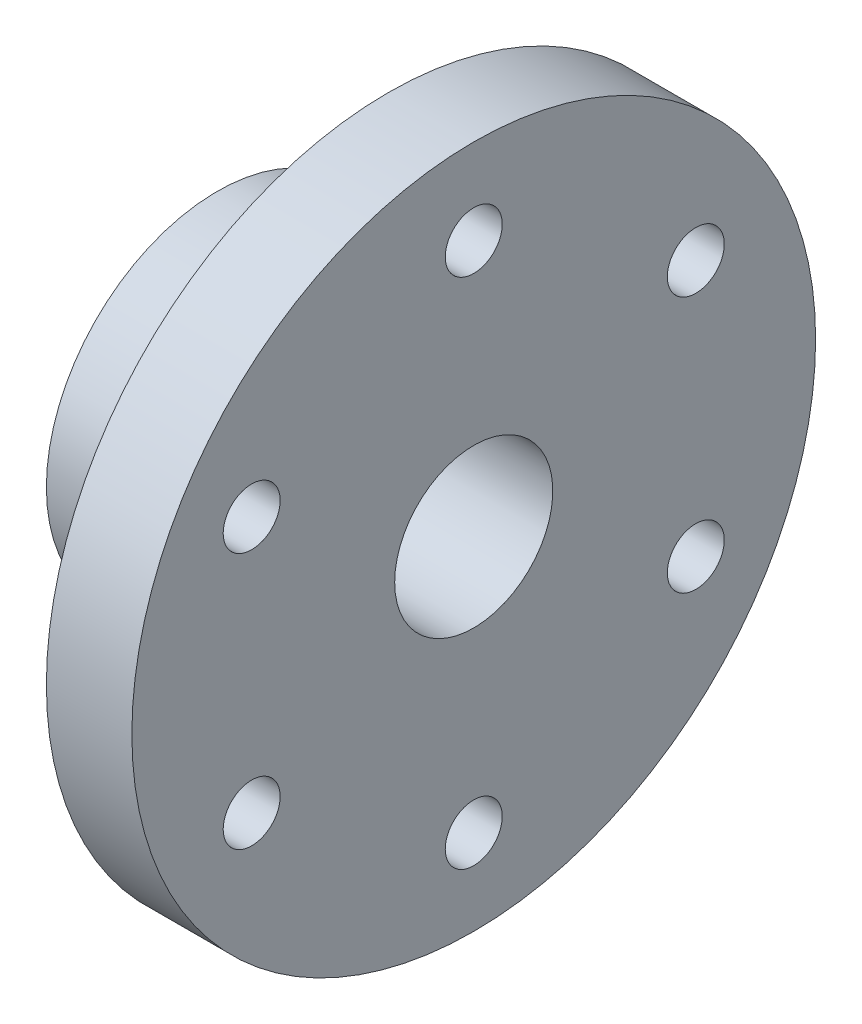
ISO-10303-21;
HEADER;
FILE_DESCRIPTION(('STEP AP214'),'2;1');
FILE_NAME('part.step','',(''),(''),'','','');
FILE_SCHEMA(('AUTOMOTIVE_DESIGN { 1 0 10303 214 1 1 1 1 }'));
ENDSEC;
DATA;
#1=APPLICATION_CONTEXT('core data for automotive mechanical design processes');
#2=APPLICATION_PROTOCOL_DEFINITION('international standard','automotive_design',2000,#1);
#3=PRODUCT_CONTEXT('',#1,'mechanical');
#4=PRODUCT('Part','Part','',(#3));
#5=PRODUCT_RELATED_PRODUCT_CATEGORY('part','',(#4));
#6=PRODUCT_DEFINITION_FORMATION('','',#4);
#7=PRODUCT_DEFINITION_CONTEXT('part definition',#1,'design');
#8=PRODUCT_DEFINITION('design','',#6,#7);
#9=PRODUCT_DEFINITION_SHAPE('','',#8);
#10=(LENGTH_UNIT() NAMED_UNIT(*) SI_UNIT(.MILLI.,.METRE.));
#11=(NAMED_UNIT(*) PLANE_ANGLE_UNIT() SI_UNIT($,.RADIAN.));
#12=(NAMED_UNIT(*) SI_UNIT($,.STERADIAN.) SOLID_ANGLE_UNIT());
#13=UNCERTAINTY_MEASURE_WITH_UNIT(LENGTH_MEASURE(1.E-05),#10,'distance_accuracy_value','');
#14=(GEOMETRIC_REPRESENTATION_CONTEXT(3) GLOBAL_UNCERTAINTY_ASSIGNED_CONTEXT((#13)) GLOBAL_UNIT_ASSIGNED_CONTEXT((#10,
#11,#12)) REPRESENTATION_CONTEXT('',''));
#15=CARTESIAN_POINT('',(0.,0.,0.));
#16=DIRECTION('',(0.,0.,1.));
#17=DIRECTION('',(1.,0.,0.));
#18=AXIS2_PLACEMENT_3D('',#15,#16,#17);
#19=CARTESIAN_POINT('',(-11.6129032258065,0.,0.));
#20=DIRECTION('',(-1.,0.,0.));
#21=DIRECTION('',(0.,0.,1.));
#22=AXIS2_PLACEMENT_3D('',#19,#20,#21);
#23=CYLINDRICAL_SURFACE('',#22,24.);
#24=CARTESIAN_POINT('',(-9.70046082949309,0.,24.));
#25=CARTESIAN_POINT('',(-9.7004697718096,-0.223025447933144,23.9999961787012));
#26=CARTESIAN_POINT('',(-9.71917646944337,-0.446172610942113,23.9968588466085));
#27=CARTESIAN_POINT('',(-9.79347788351762,-0.886208354676868,23.9846455190622));
#28=CARTESIAN_POINT('',(-9.84910652055166,-1.1030909887348,23.9755640627822));
#29=CARTESIAN_POINT('',(-9.9955255472415,-1.52416759554023,23.9524810917832));
#30=CARTESIAN_POINT('',(-10.086287174518,-1.72837178949104,23.9384836025471));
#31=CARTESIAN_POINT('',(-10.3003204967769,-2.11862694716471,23.9071076333131));
#32=CARTESIAN_POINT('',(-10.4235884734659,-2.30467998380575,23.8897295400709));
#33=CARTESIAN_POINT('',(-10.7003889636058,-2.65515618286669,23.853333079333));
#34=CARTESIAN_POINT('',(-10.8541714129109,-2.81938064565595,23.8343019490377));
#35=CARTESIAN_POINT('',(-11.1870975790496,-3.11982159785588,23.7968420300277));
#36=CARTESIAN_POINT('',(-11.3662428958237,-3.25603631902555,23.7784132794027));
#37=CARTESIAN_POINT('',(-11.7461743754084,-3.49738740096821,23.7441210521565));
#38=CARTESIAN_POINT('',(-11.9470869683807,-3.6023272845776,23.7282740654662));
#39=CARTESIAN_POINT('',(-12.3639961323741,-3.77689338465795,23.7011166367148));
#40=CARTESIAN_POINT('',(-12.5799916833773,-3.84652198650498,23.6898058882289));
#41=CARTESIAN_POINT('',(-13.0188292692636,-3.94786300445569,23.6731285894841));
#42=CARTESIAN_POINT('',(-13.2415900078953,-3.97991844661664,23.6677082957712));
#43=CARTESIAN_POINT('',(-13.6893892725066,-4.0062667604638,23.6632630229864));
#44=CARTESIAN_POINT('',(-13.9144276361608,-4.0005623046224,23.6642375913154));
#45=CARTESIAN_POINT('',(-14.3579454075338,-3.95183215743384,23.6724228618169));
#46=CARTESIAN_POINT('',(-14.5764685151655,-3.90919181102364,23.6795691731027));
#47=CARTESIAN_POINT('',(-15.0032149380197,-3.78840502464551,23.6991919233761));
#48=CARTESIAN_POINT('',(-15.2114378997148,-3.71025736691159,23.7116685451723));
#49=CARTESIAN_POINT('',(-15.6128269469986,-3.52028359375026,23.7406156693456));
#50=CARTESIAN_POINT('',(-15.8059158792231,-3.40829746220754,23.7571050737172));
#51=CARTESIAN_POINT('',(-16.1707078703545,-3.1539392280919,23.7922066946401));
#52=CARTESIAN_POINT('',(-16.342409201421,-3.01156467304686,23.8108190824686));
#53=CARTESIAN_POINT('',(-16.6617825667848,-2.69837153945449,23.8483524460766));
#54=CARTESIAN_POINT('',(-16.8091304591572,-2.527222342197,23.8672743877064));
#55=CARTESIAN_POINT('',(-17.0730652497576,-2.16245639837063,23.9030816223476));
#56=CARTESIAN_POINT('',(-17.1896519497863,-1.96883950705028,23.9199669022359));
#57=CARTESIAN_POINT('',(-17.3887843929111,-1.56432946586674,23.9498222862866));
#58=CARTESIAN_POINT('',(-17.4713015004231,-1.35342196090346,23.9627890945191));
#59=CARTESIAN_POINT('',(-17.5996515738867,-0.92047735296437,23.9833200482025));
#60=CARTESIAN_POINT('',(-17.645487608651,-0.69844118268715,23.9908846456076));
#61=CARTESIAN_POINT('',(-17.6987350030309,-0.252335842082599,23.999698077483));
#62=CARTESIAN_POINT('',(-17.7065913443821,-0.028321179441619,24.0010200482045));
#63=CARTESIAN_POINT('',(-17.6848426784081,0.417823636623819,23.9973995907387));
#64=CARTESIAN_POINT('',(-17.6552391124791,0.639953862227262,23.9924574035859));
#65=CARTESIAN_POINT('',(-17.5597810705563,1.07464988087482,23.9769092310112));
#66=CARTESIAN_POINT('',(-17.4941468960689,1.28726538941661,23.966337676821));
#67=CARTESIAN_POINT('',(-17.3287256003738,1.69847501577671,23.9407114312857));
#68=CARTESIAN_POINT('',(-17.2289365612767,1.89706834545555,23.9256564881923));
#69=CARTESIAN_POINT('',(-16.9970190299782,2.27652910315033,23.8925522608385));
#70=CARTESIAN_POINT('',(-16.8646125796255,2.45722440149944,23.8744776941924));
#71=CARTESIAN_POINT('',(-16.571601124877,2.7939897368043,23.8374154782704));
#72=CARTESIAN_POINT('',(-16.4109940722504,2.95005798351453,23.8184277627447));
#73=CARTESIAN_POINT('',(-16.0641447525788,3.2347884474528,23.7814428037735));
#74=CARTESIAN_POINT('',(-15.87765416467,3.36315001778194,23.7634578581937));
#75=CARTESIAN_POINT('',(-15.4854960788714,3.58672369647198,23.7307444764461));
#76=CARTESIAN_POINT('',(-15.2798291891291,3.68193685563172,23.7160159370563));
#77=CARTESIAN_POINT('',(-14.8559972569937,3.83606133035704,23.6915752591633));
#78=CARTESIAN_POINT('',(-14.6378878774443,3.89512229207671,23.681842468977));
#79=CARTESIAN_POINT('',(-14.1946686227383,3.97573672604524,23.6684434693642));
#80=CARTESIAN_POINT('',(-13.9695593579218,3.99729345911387,23.6647767325235));
#81=CARTESIAN_POINT('',(-13.5217325639532,4.00219658567577,23.6639477293442));
#82=CARTESIAN_POINT('',(-13.2990202237726,3.9860162178003,23.6667049040904));
#83=CARTESIAN_POINT('',(-12.8595340326119,3.91692774233096,23.6782365032596));
#84=CARTESIAN_POINT('',(-12.6427601623861,3.86401975377996,23.6870109081794));
#85=CARTESIAN_POINT('',(-12.2214873298249,3.72315918335184,23.7095577005075));
#86=CARTESIAN_POINT('',(-12.0169744134035,3.63524734496071,23.7233242755147));
#87=CARTESIAN_POINT('',(-11.6255237587813,3.42692320626545,23.7543099027553));
#88=CARTESIAN_POINT('',(-11.4385868928977,3.3065092939977,23.7715291262144));
#89=CARTESIAN_POINT('',(-11.0852038965207,3.03491021499545,23.8077352647299));
#90=CARTESIAN_POINT('',(-10.9190272027727,2.88337690174984,23.8267407292208));
#91=CARTESIAN_POINT('',(-10.6142982623332,2.55457445020837,23.8642299577735));
#92=CARTESIAN_POINT('',(-10.475752399672,2.37729938066022,23.8827136004247));
#93=CARTESIAN_POINT('',(-10.2293436003732,2.00059067142445,23.9172244742755));
#94=CARTESIAN_POINT('',(-10.1216991665924,1.80101246005251,23.9332338600497));
#95=CARTESIAN_POINT('',(-9.94162965411722,1.38642091100637,23.9608186816284));
#96=CARTESIAN_POINT('',(-9.86916949976558,1.17142319172802,23.9723985308397));
#97=CARTESIAN_POINT('',(-9.77725239089043,0.796325296072642,23.9872926533273));
#98=CARTESIAN_POINT('',(-9.74850167810755,0.638494128477517,23.9920324363737));
#99=CARTESIAN_POINT('',(-9.71010284894149,0.320462896511695,23.9983874557779));
#100=CARTESIAN_POINT('',(-9.70045440367331,0.160262872973591,24.0000027459303));
#101=CARTESIAN_POINT('',(-9.70046082949309,0.,24.));
#102=B_SPLINE_CURVE_WITH_KNOTS('',3,(#24,#25,#26,#27,#28,#29,#30,#31,#32,#33,#34,#35,#36,#37,
#38,#39,#40,#41,#42,#43,#44,#45,#46,#47,#48,#49,#50,#51,#52,#53,#54,#55,#56,#57,#58,#59,#60,#61,
#62,#63,#64,#65,#66,#67,#68,#69,#70,#71,#72,#73,#74,#75,#76,#77,#78,#79,#80,#81,#82,#83,#84,#85,
#86,#87,#88,#89,#90,#91,#92,#93,#94,#95,#96,#97,#98,#99,#100,#101),.UNSPECIFIED.,.T.,.F.,(4,2,2,
2,2,2,2,2,2,2,2,2,2,2,2,2,2,2,2,2,2,2,2,2,2,2,2,2,2,2,2,2,2,2,2,2,2,2,4),(0.,0.668490535901615,
1.33759607311267,2.00615498724043,2.67463746027966,3.34883985699731,4.02308480271771,
4.70148033318144,5.3798300300189,6.05193723365478,6.72399686913418,7.38912834816654,
8.0542826404061,8.72263290612092,9.39103713088918,10.0677243185812,10.7444158661736,
11.4216750226545,12.0988775123384,12.7681261358624,13.4373490085738,14.1025249121026,
14.7677381732171,15.4388292100324,16.1099690088685,16.7880611521219,17.4661317980151,
18.1413763574684,18.8165622045859,19.4833265523632,20.1500887390101,20.8160770916196,
21.4820984804694,22.1560221470943,22.8301013420636,23.5088357057152,24.1868920340812,
24.6672679706243,25.1476356364315),.UNSPECIFIED.);
#103=CARTESIAN_POINT('',(-9.70046082949309,0.,24.));
#104=VERTEX_POINT('',#103);
#105=EDGE_CURVE('E90',#104,#104,#102,.T.);
#106=ORIENTED_EDGE('',*,*,#105,.T.);
#107=EDGE_LOOP('',(#106));
#108=FACE_BOUND('',#107,.T.);
#109=CARTESIAN_POINT('',(-25.7004608294931,0.,0.));
#110=DIRECTION('',(-1.,0.,0.));
#111=DIRECTION('',(0.,0.,1.));
#112=AXIS2_PLACEMENT_3D('',#109,#110,#111);
#113=CIRCLE('',#112,24.);
#114=CARTESIAN_POINT('',(-25.7004608294931,0.,24.));
#115=VERTEX_POINT('',#114);
#116=EDGE_CURVE('E10',#115,#115,#113,.T.);
#117=ORIENTED_EDGE('',*,*,#116,.F.);
#118=EDGE_LOOP('',(#117));
#119=FACE_BOUND('',#118,.T.);
#120=CARTESIAN_POINT('',(-1.70046082949309,0.,0.));
#121=DIRECTION('',(-1.,0.,0.));
#122=DIRECTION('',(0.,0.,1.));
#123=AXIS2_PLACEMENT_3D('',#120,#121,#122);
#124=CIRCLE('',#123,24.);
#125=CARTESIAN_POINT('',(-1.70046082949309,0.,24.));
#126=VERTEX_POINT('',#125);
#127=EDGE_CURVE('E55',#126,#126,#124,.T.);
#128=ORIENTED_EDGE('',*,*,#127,.T.);
#129=EDGE_LOOP('',(#128));
#130=FACE_BOUND('',#129,.T.);
#131=ADVANCED_FACE('F32',(#108,#119,#130),#23,.T.);
#132=CARTESIAN_POINT('',(-25.7004608294931,11.1,0.));
#133=DIRECTION('',(1.,0.,0.));
#134=DIRECTION('',(0.,0.,-1.));
#135=AXIS2_PLACEMENT_3D('',#132,#133,#134);
#136=PLANE('',#135);
#137=CARTESIAN_POINT('',(-25.7004608294931,0.,0.));
#138=DIRECTION('',(-1.,0.,0.));
#139=DIRECTION('',(0.,0.,1.));
#140=AXIS2_PLACEMENT_3D('',#137,#138,#139);
#141=CIRCLE('',#140,11.1);
#142=CARTESIAN_POINT('',(-25.7004608294931,0.,11.1));
#143=VERTEX_POINT('',#142);
#144=EDGE_CURVE('E39',#143,#143,#141,.T.);
#145=ORIENTED_EDGE('',*,*,#144,.F.);
#146=EDGE_LOOP('',(#145));
#147=FACE_BOUND('',#146,.T.);
#148=ORIENTED_EDGE('',*,*,#116,.T.);
#149=EDGE_LOOP('',(#148));
#150=FACE_BOUND('',#149,.T.);
#151=ADVANCED_FACE('F151',(#147,#150),#136,.F.);
#152=CARTESIAN_POINT('',(-11.6129032258065,0.,0.));
#153=DIRECTION('',(-1.,0.,0.));
#154=DIRECTION('',(0.,0.,1.));
#155=AXIS2_PLACEMENT_3D('',#152,#153,#154);
#156=CYLINDRICAL_SURFACE('',#155,11.1);
#157=CARTESIAN_POINT('',(-9.70046082949309,0.,11.1));
#158=CARTESIAN_POINT('',(-9.70045577108389,-0.217216618898547,11.1000036677997));
#159=CARTESIAN_POINT('',(-9.71821069737451,-0.434397419127927,11.0935671862936));
#160=CARTESIAN_POINT('',(-9.78849966258006,-0.862301453856844,11.0685304589151));
#161=CARTESIAN_POINT('',(-9.84103170703669,-1.07302505794977,11.049930910592));
#162=CARTESIAN_POINT('',(-9.97879813032089,-1.48178351730868,11.0025735524127));
#163=CARTESIAN_POINT('',(-10.0639724306934,-1.67984090803647,10.9738344122637));
#164=CARTESIAN_POINT('',(-10.2643123098248,-2.05884964258268,10.9090857081488));
#165=CARTESIAN_POINT('',(-10.379485235332,-2.23979678123494,10.8730743636855));
#166=CARTESIAN_POINT('',(-10.641335377689,-2.58662726021929,10.7959281925309));
#167=CARTESIAN_POINT('',(-10.7889920197429,-2.75174039279639,10.7546561883183));
#168=CARTESIAN_POINT('',(-11.1095382989785,-3.05546974190143,10.6723433795021));
#169=CARTESIAN_POINT('',(-11.2824348026464,-3.19407872421639,10.6313026409798));
#170=CARTESIAN_POINT('',(-11.6558618342691,-3.44557751347248,10.5525352586091));
#171=CARTESIAN_POINT('',(-11.8571416875724,-3.55741111015791,10.51497248268));
#172=CARTESIAN_POINT('',(-12.277222358985,-3.74530081075661,10.4495308172368));
#173=CARTESIAN_POINT('',(-12.4960167527226,-3.82136996341279,10.4216483967946));
#174=CARTESIAN_POINT('',(-12.9360830128534,-3.93258516524641,10.3801828295834));
#175=CARTESIAN_POINT('',(-13.1569361960111,-3.96919217103409,10.3660911234836));
#176=CARTESIAN_POINT('',(-13.6020654574061,-4.00501241228621,10.3523079757702));
#177=CARTESIAN_POINT('',(-13.8263402261681,-4.00423961145143,10.3526111567633));
#178=CARTESIAN_POINT('',(-14.2589232562499,-3.9664454427848,10.3671424021891));
#179=CARTESIAN_POINT('',(-14.4674347917533,-3.93140511631736,10.3806094309751));
#180=CARTESIAN_POINT('',(-14.875391453863,-3.82932980894775,10.418693283566));
#181=CARTESIAN_POINT('',(-15.074835315726,-3.76229037976972,10.4433116575231));
#182=CARTESIAN_POINT('',(-15.4631992787148,-3.5969580295675,10.5014123473317));
#183=CARTESIAN_POINT('',(-15.6518659019734,-3.49812519483223,10.5350459809749));
#184=CARTESIAN_POINT('',(-16.0105301209303,-3.27238706537428,10.607332402667));
#185=CARTESIAN_POINT('',(-16.1805216051682,-3.14547262162421,10.645986824797));
#186=CARTESIAN_POINT('',(-16.5080387567402,-2.85794684393414,10.7268704725522));
#187=CARTESIAN_POINT('',(-16.6641487084318,-2.69573986549957,10.7691731305716));
#188=CARTESIAN_POINT('',(-16.9473533859277,-2.34694698345684,10.8505241229456));
#189=CARTESIAN_POINT('',(-17.0744443093173,-2.1603578900475,10.8895720303993));
#190=CARTESIAN_POINT('',(-17.2974068102601,-1.76470908178319,10.9606878025247));
#191=CARTESIAN_POINT('',(-17.3928406230375,-1.55538347982955,10.9926559100633));
#192=CARTESIAN_POINT('',(-17.5466799984054,-1.12221352602812,11.0452767145418));
#193=CARTESIAN_POINT('',(-17.6051006965056,-0.898375150116255,11.0659340362513));
#194=CARTESIAN_POINT('',(-17.6806119455979,-0.454474246330642,11.0928097209141));
#195=CARTESIAN_POINT('',(-17.6996111875772,-0.234776381211075,11.0996942866314));
#196=CARTESIAN_POINT('',(-17.7012541183416,0.204748811496262,11.1002854061125));
#197=CARTESIAN_POINT('',(-17.6839051461205,0.42457610399239,11.0939946200849));
#198=CARTESIAN_POINT('',(-17.6148182233676,0.850094279993616,11.0693821138511));
#199=CARTESIAN_POINT('',(-17.5643018450618,1.05601076330863,11.0514880285444));
#200=CARTESIAN_POINT('',(-17.4318928492556,1.45632431062248,11.0058955989415));
#201=CARTESIAN_POINT('',(-17.3499961537448,1.65071987363417,10.9781959804087));
#202=CARTESIAN_POINT('',(-17.1546027204022,2.02865590704337,10.9147760514003));
#203=CARTESIAN_POINT('',(-17.0402735830839,2.21173047774159,10.878850052358));
#204=CARTESIAN_POINT('',(-16.7842138569878,2.55668673116662,10.8029902145338));
#205=CARTESIAN_POINT('',(-16.6424737341169,2.71856100705091,10.763054983591));
#206=CARTESIAN_POINT('',(-16.3266802258103,3.02555939269694,10.6809453846636));
#207=CARTESIAN_POINT('',(-16.1513042780573,3.16932504013694,10.6387654680166));
#208=CARTESIAN_POINT('',(-15.7780526630379,3.42561801459676,10.559034561974));
#209=CARTESIAN_POINT('',(-15.5801757480724,3.53814360813533,10.5214838295116));
#210=CARTESIAN_POINT('',(-15.1665413467906,3.72860621162998,10.4555118387731));
#211=CARTESIAN_POINT('',(-14.950756261635,3.80648861162101,10.4271050138793));
#212=CARTESIAN_POINT('',(-14.50784071553,3.92435690195699,10.3833257254739));
#213=CARTESIAN_POINT('',(-14.2807166266602,3.96436383001615,10.3679460266202));
#214=CARTESIAN_POINT('',(-13.8361612019318,4.00354633094279,10.3528746953999));
#215=CARTESIAN_POINT('',(-13.6189600086165,4.00501551734795,10.3523018495131));
#216=CARTESIAN_POINT('',(-13.1875822779526,3.9728734993801,10.3646787904784));
#217=CARTESIAN_POINT('',(-12.9734054981326,3.93926512359326,10.3776274869797));
#218=CARTESIAN_POINT('',(-12.5597735164741,3.83965299108029,10.4148816933837));
#219=CARTESIAN_POINT('',(-12.3600803294756,3.77451430626248,10.4388831471888));
#220=CARTESIAN_POINT('',(-11.9743242443391,3.61442830949985,10.495383666482));
#221=CARTESIAN_POINT('',(-11.7882646710442,3.51947375597137,10.5278847960236));
#222=CARTESIAN_POINT('',(-11.4250746579787,3.29699598639465,10.5997219785334));
#223=CARTESIAN_POINT('',(-11.2488395194924,3.16809547458699,10.6393163821297));
#224=CARTESIAN_POINT('',(-10.9197648778929,2.88358661303405,10.7199238640854));
#225=CARTESIAN_POINT('',(-10.766932540985,2.72797011336611,10.7609373722965));
#226=CARTESIAN_POINT('',(-10.4814884456053,2.38542835212334,10.8421461961024));
#227=CARTESIAN_POINT('',(-10.3502134170354,2.19735227122791,10.8822058297863));
#228=CARTESIAN_POINT('',(-10.1212211670102,1.80042322025713,10.9548679468535));
#229=CARTESIAN_POINT('',(-10.0235022931234,1.5915712739171,10.9874707974105));
#230=CARTESIAN_POINT('',(-9.86419665506637,1.15642623968461,11.0417941479022));
#231=CARTESIAN_POINT('',(-9.80302248997312,0.92996545740235,11.0633899904646));
#232=CARTESIAN_POINT('',(-9.7211655752826,0.468986984757081,11.0924880591668));
#233=CARTESIAN_POINT('',(-9.70046628974972,0.234472624531695,11.099996040825));
#234=CARTESIAN_POINT('',(-9.70046082949309,0.,11.1));
#235=B_SPLINE_CURVE_WITH_KNOTS('',3,(#157,#158,#159,#160,#161,#162,#163,#164,#165,#166,#167,
#168,#169,#170,#171,#172,#173,#174,#175,#176,#177,#178,#179,#180,#181,#182,#183,#184,#185,#186,
#187,#188,#189,#190,#191,#192,#193,#194,#195,#196,#197,#198,#199,#200,#201,#202,#203,#204,#205,
#206,#207,#208,#209,#210,#211,#212,#213,#214,#215,#216,#217,#218,#219,#220,#221,#222,#223,#224,
#225,#226,#227,#228,#229,#230,#231,#232,#233,#234),.UNSPECIFIED.,.T.,.F.,(4,2,2,2,2,2,2,2,2,2,2,
2,2,2,2,2,2,2,2,2,2,2,2,2,2,2,2,2,2,2,2,2,2,2,2,2,2,2,4),(0.,0.650785699236126,1.30153407932134,
1.95109045713628,2.60080606296678,3.27375863490819,3.94689462547237,4.64332854909211,
5.33950817956733,6.00892120966243,6.67808417396337,7.31071883797618,7.94344147175084,
8.58753274700214,9.23183417788969,9.91587813748762,10.6000116772082,11.2932455051655,
11.9861956706637,12.6447279219913,13.3031272232289,13.9385434756258,14.574042331183,
15.2276132429251,15.8814118899878,16.5701696452403,17.2589656113784,17.9488435494735,
18.6383380736073,19.2866971217152,19.935003891454,20.5664533039616,21.198056199681,
21.8608637413338,22.5238738381054,23.2189742860337,23.9140404996855,24.6168127422009,
25.319297808405),.UNSPECIFIED.);
#236=CARTESIAN_POINT('',(-9.70046082949309,0.,11.1));
#237=VERTEX_POINT('',#236);
#238=EDGE_CURVE('E101',#237,#237,#235,.T.);
#239=ORIENTED_EDGE('',*,*,#238,.F.);
#240=EDGE_LOOP('',(#239));
#241=FACE_BOUND('',#240,.T.);
#242=CARTESIAN_POINT('',(10.2995391705069,0.,0.));
#243=DIRECTION('',(-1.,0.,0.));
#244=DIRECTION('',(0.,0.,1.));
#245=AXIS2_PLACEMENT_3D('',#242,#243,#244);
#246=CIRCLE('',#245,11.1);
#247=CARTESIAN_POINT('',(10.2995391705069,0.,11.1));
#248=VERTEX_POINT('',#247);
#249=EDGE_CURVE('E43',#248,#248,#246,.T.);
#250=ORIENTED_EDGE('',*,*,#249,.F.);
#251=EDGE_LOOP('',(#250));
#252=FACE_BOUND('',#251,.T.);
#253=ORIENTED_EDGE('',*,*,#144,.T.);
#254=EDGE_LOOP('',(#253));
#255=FACE_BOUND('',#254,.T.);
#256=ADVANCED_FACE('F148',(#241,#252,#255),#156,.F.);
#257=CARTESIAN_POINT('',(10.2995391705069,48.,0.));
#258=DIRECTION('',(-1.,0.,0.));
#259=DIRECTION('',(0.,0.,1.));
#260=AXIS2_PLACEMENT_3D('',#257,#258,#259);
#261=PLANE('',#260);
#262=CARTESIAN_POINT('',(10.2995391705069,36.,0.));
#263=DIRECTION('',(-1.,0.,0.));
#264=DIRECTION('',(0.,0.,1.));
#265=AXIS2_PLACEMENT_3D('',#262,#263,#264);
#266=CIRCLE('',#265,4.);
#267=CARTESIAN_POINT('',(10.2995391705069,36.,4.));
#268=VERTEX_POINT('',#267);
#269=EDGE_CURVE('E58',#268,#268,#266,.F.);
#270=ORIENTED_EDGE('',*,*,#269,.F.);
#271=EDGE_LOOP('',(#270));
#272=FACE_BOUND('',#271,.T.);
#273=CARTESIAN_POINT('',(10.2995391705069,17.9999999999991,-31.1769145362393));
#274=DIRECTION('',(-1.,0.,0.));
#275=DIRECTION('',(0.,0.,1.));
#276=AXIS2_PLACEMENT_3D('',#273,#274,#275);
#277=CIRCLE('',#276,4.);
#278=CARTESIAN_POINT('',(10.2995391705069,17.9999999999991,-27.1769145362393));
#279=VERTEX_POINT('',#278);
#280=EDGE_CURVE('E66',#279,#279,#277,.F.);
#281=ORIENTED_EDGE('',*,*,#280,.F.);
#282=EDGE_LOOP('',(#281));
#283=FACE_BOUND('',#282,.T.);
#284=CARTESIAN_POINT('',(10.2995391705069,-18.0000000000009,-31.1769145362383));
#285=DIRECTION('',(-1.,0.,0.));
#286=DIRECTION('',(0.,0.,1.));
#287=AXIS2_PLACEMENT_3D('',#284,#285,#286);
#288=CIRCLE('',#287,4.);
#289=CARTESIAN_POINT('',(10.2995391705069,-18.0000000000009,-27.1769145362383));
#290=VERTEX_POINT('',#289);
#291=EDGE_CURVE('E59',#290,#290,#288,.F.);
#292=ORIENTED_EDGE('',*,*,#291,.F.);
#293=EDGE_LOOP('',(#292));
#294=FACE_BOUND('',#293,.T.);
#295=CARTESIAN_POINT('',(10.2995391705069,-36.,1.95916913198922E-12));
#296=DIRECTION('',(-1.,0.,0.));
#297=DIRECTION('',(0.,0.,1.));
#298=AXIS2_PLACEMENT_3D('',#295,#296,#297);
#299=CIRCLE('',#298,4.);
#300=CARTESIAN_POINT('',(10.2995391705069,-36.,4.00000000000196));
#301=VERTEX_POINT('',#300);
#302=EDGE_CURVE('E67',#301,#301,#299,.F.);
#303=ORIENTED_EDGE('',*,*,#302,.F.);
#304=EDGE_LOOP('',(#303));
#305=FACE_BOUND('',#304,.T.);
#306=CARTESIAN_POINT('',(10.2995391705069,-17.9999999999991,31.1769145362413));
#307=DIRECTION('',(-1.,0.,0.));
#308=DIRECTION('',(0.,0.,1.));
#309=AXIS2_PLACEMENT_3D('',#306,#307,#308);
#310=CIRCLE('',#309,4.00000000000001);
#311=CARTESIAN_POINT('',(10.2995391705069,-17.9999999999991,35.1769145362413));
#312=VERTEX_POINT('',#311);
#313=EDGE_CURVE('E73',#312,#312,#310,.F.);
#314=ORIENTED_EDGE('',*,*,#313,.F.);
#315=EDGE_LOOP('',(#314));
#316=FACE_BOUND('',#315,.T.);
#317=CARTESIAN_POINT('',(10.2995391705069,18.0000000000009,31.1769145362403));
#318=DIRECTION('',(-1.,0.,0.));
#319=DIRECTION('',(0.,0.,1.));
#320=AXIS2_PLACEMENT_3D('',#317,#318,#319);
#321=CIRCLE('',#320,4.00000000000001);
#322=CARTESIAN_POINT('',(10.2995391705069,18.0000000000009,35.1769145362403));
#323=VERTEX_POINT('',#322);
#324=EDGE_CURVE('E79',#323,#323,#321,.F.);
#325=ORIENTED_EDGE('',*,*,#324,.F.);
#326=EDGE_LOOP('',(#325));
#327=FACE_BOUND('',#326,.T.);
#328=CARTESIAN_POINT('',(10.2995391705069,0.,0.));
#329=DIRECTION('',(-1.,0.,0.));
#330=DIRECTION('',(0.,0.,1.));
#331=AXIS2_PLACEMENT_3D('',#328,#329,#330);
#332=CIRCLE('',#331,48.);
#333=CARTESIAN_POINT('',(10.2995391705069,0.,48.));
#334=VERTEX_POINT('',#333);
#335=EDGE_CURVE('E47',#334,#334,#332,.T.);
#336=ORIENTED_EDGE('',*,*,#335,.F.);
#337=EDGE_LOOP('',(#336));
#338=FACE_BOUND('',#337,.T.);
#339=ORIENTED_EDGE('',*,*,#249,.T.);
#340=EDGE_LOOP('',(#339));
#341=FACE_BOUND('',#340,.T.);
#342=ADVANCED_FACE('F144',(#272,#283,#294,#305,#316,#327,#338,#341),#261,.F.);
#343=CARTESIAN_POINT('',(-11.6129032258065,0.,0.));
#344=DIRECTION('',(-1.,0.,0.));
#345=DIRECTION('',(0.,0.,1.));
#346=AXIS2_PLACEMENT_3D('',#343,#344,#345);
#347=CYLINDRICAL_SURFACE('',#346,48.);
#348=CARTESIAN_POINT('',(-1.70046082949309,0.,0.));
#349=DIRECTION('',(-1.,0.,0.));
#350=DIRECTION('',(0.,0.,1.));
#351=AXIS2_PLACEMENT_3D('',#348,#349,#350);
#352=CIRCLE('',#351,48.);
#353=CARTESIAN_POINT('',(-1.70046082949309,0.,48.));
#354=VERTEX_POINT('',#353);
#355=EDGE_CURVE('E52',#354,#354,#352,.T.);
#356=ORIENTED_EDGE('',*,*,#355,.F.);
#357=EDGE_LOOP('',(#356));
#358=FACE_BOUND('',#357,.T.);
#359=ORIENTED_EDGE('',*,*,#335,.T.);
#360=EDGE_LOOP('',(#359));
#361=FACE_BOUND('',#360,.T.);
#362=ADVANCED_FACE('F140',(#358,#361),#347,.T.);
#363=CARTESIAN_POINT('',(-1.70046082949309,24.,0.));
#364=DIRECTION('',(1.,0.,0.));
#365=DIRECTION('',(0.,0.,-1.));
#366=AXIS2_PLACEMENT_3D('',#363,#364,#365);
#367=PLANE('',#366);
#368=CARTESIAN_POINT('',(-1.70046082949309,36.,0.));
#369=DIRECTION('',(-1.,0.,0.));
#370=DIRECTION('',(0.,0.,1.));
#371=AXIS2_PLACEMENT_3D('',#368,#369,#370);
#372=CIRCLE('',#371,4.);
#373=CARTESIAN_POINT('',(-1.70046082949309,36.,4.));
#374=VERTEX_POINT('',#373);
#375=EDGE_CURVE('E82',#374,#374,#372,.T.);
#376=ORIENTED_EDGE('',*,*,#375,.F.);
#377=EDGE_LOOP('',(#376));
#378=FACE_BOUND('',#377,.T.);
#379=CARTESIAN_POINT('',(-1.70046082949309,17.9999999999991,-31.1769145362393));
#380=DIRECTION('',(-1.,0.,0.));
#381=DIRECTION('',(0.,0.,1.));
#382=AXIS2_PLACEMENT_3D('',#379,#380,#381);
#383=CIRCLE('',#382,4.);
#384=CARTESIAN_POINT('',(-1.70046082949309,17.9999999999991,-27.1769145362393));
#385=VERTEX_POINT('',#384);
#386=EDGE_CURVE('E87',#385,#385,#383,.T.);
#387=ORIENTED_EDGE('',*,*,#386,.F.);
#388=EDGE_LOOP('',(#387));
#389=FACE_BOUND('',#388,.T.);
#390=CARTESIAN_POINT('',(-1.70046082949309,-18.0000000000009,-31.1769145362383));
#391=DIRECTION('',(-1.,0.,0.));
#392=DIRECTION('',(0.,0.,1.));
#393=AXIS2_PLACEMENT_3D('',#390,#391,#392);
#394=CIRCLE('',#393,4.);
#395=CARTESIAN_POINT('',(-1.70046082949309,-18.0000000000009,-27.1769145362383));
#396=VERTEX_POINT('',#395);
#397=EDGE_CURVE('E63',#396,#396,#394,.T.);
#398=ORIENTED_EDGE('',*,*,#397,.F.);
#399=EDGE_LOOP('',(#398));
#400=FACE_BOUND('',#399,.T.);
#401=CARTESIAN_POINT('',(-1.70046082949309,-36.,1.95916913198922E-12));
#402=DIRECTION('',(-1.,0.,0.));
#403=DIRECTION('',(0.,0.,1.));
#404=AXIS2_PLACEMENT_3D('',#401,#402,#403);
#405=CIRCLE('',#404,4.);
#406=CARTESIAN_POINT('',(-1.70046082949309,-36.,4.00000000000196));
#407=VERTEX_POINT('',#406);
#408=EDGE_CURVE('E62',#407,#407,#405,.T.);
#409=ORIENTED_EDGE('',*,*,#408,.F.);
#410=EDGE_LOOP('',(#409));
#411=FACE_BOUND('',#410,.T.);
#412=CARTESIAN_POINT('',(-1.70046082949309,-17.9999999999991,31.1769145362413));
#413=DIRECTION('',(-1.,0.,0.));
#414=DIRECTION('',(0.,0.,1.));
#415=AXIS2_PLACEMENT_3D('',#412,#413,#414);
#416=CIRCLE('',#415,4.00000000000001);
#417=CARTESIAN_POINT('',(-1.70046082949309,-17.9999999999991,35.1769145362413));
#418=VERTEX_POINT('',#417);
#419=EDGE_CURVE('E70',#418,#418,#416,.T.);
#420=ORIENTED_EDGE('',*,*,#419,.F.);
#421=EDGE_LOOP('',(#420));
#422=FACE_BOUND('',#421,.T.);
#423=CARTESIAN_POINT('',(-1.70046082949309,18.0000000000009,31.1769145362403));
#424=DIRECTION('',(-1.,0.,0.));
#425=DIRECTION('',(0.,0.,1.));
#426=AXIS2_PLACEMENT_3D('',#423,#424,#425);
#427=CIRCLE('',#426,4.00000000000001);
#428=CARTESIAN_POINT('',(-1.70046082949309,18.0000000000009,35.1769145362403));
#429=VERTEX_POINT('',#428);
#430=EDGE_CURVE('E76',#429,#429,#427,.T.);
#431=ORIENTED_EDGE('',*,*,#430,.F.);
#432=EDGE_LOOP('',(#431));
#433=FACE_BOUND('',#432,.T.);
#434=ORIENTED_EDGE('',*,*,#127,.F.);
#435=EDGE_LOOP('',(#434));
#436=FACE_BOUND('',#435,.T.);
#437=ORIENTED_EDGE('',*,*,#355,.T.);
#438=EDGE_LOOP('',(#437));
#439=FACE_BOUND('',#438,.T.);
#440=ADVANCED_FACE('F126',(#378,#389,#400,#411,#422,#433,#436,#439),#367,.F.);
#441=CARTESIAN_POINT('',(21.6132476694917,18.0000000000009,31.1769145362403));
#442=DIRECTION('',(-1.,0.,0.));
#443=DIRECTION('',(0.,0.,1.));
#444=AXIS2_PLACEMENT_3D('',#441,#442,#443);
#445=CYLINDRICAL_SURFACE('',#444,4.00000000000001);
#446=ORIENTED_EDGE('',*,*,#324,.T.);
#447=EDGE_LOOP('',(#446));
#448=FACE_BOUND('',#447,.T.);
#449=ORIENTED_EDGE('',*,*,#430,.T.);
#450=EDGE_LOOP('',(#449));
#451=FACE_BOUND('',#450,.T.);
#452=ADVANCED_FACE('F122',(#448,#451),#445,.F.);
#453=CARTESIAN_POINT('',(21.6132476694917,-17.9999999999991,31.1769145362413));
#454=DIRECTION('',(-1.,0.,0.));
#455=DIRECTION('',(0.,0.,1.));
#456=AXIS2_PLACEMENT_3D('',#453,#454,#455);
#457=CYLINDRICAL_SURFACE('',#456,4.00000000000001);
#458=ORIENTED_EDGE('',*,*,#313,.T.);
#459=EDGE_LOOP('',(#458));
#460=FACE_BOUND('',#459,.T.);
#461=ORIENTED_EDGE('',*,*,#419,.T.);
#462=EDGE_LOOP('',(#461));
#463=FACE_BOUND('',#462,.T.);
#464=ADVANCED_FACE('F125',(#460,#463),#457,.F.);
#465=CARTESIAN_POINT('',(21.6132476694917,-36.,1.95916913198922E-12));
#466=DIRECTION('',(-1.,0.,0.));
#467=DIRECTION('',(0.,0.,1.));
#468=AXIS2_PLACEMENT_3D('',#465,#466,#467);
#469=CYLINDRICAL_SURFACE('',#468,4.);
#470=ORIENTED_EDGE('',*,*,#302,.T.);
#471=EDGE_LOOP('',(#470));
#472=FACE_BOUND('',#471,.T.);
#473=ORIENTED_EDGE('',*,*,#408,.T.);
#474=EDGE_LOOP('',(#473));
#475=FACE_BOUND('',#474,.T.);
#476=ADVANCED_FACE('F130',(#472,#475),#469,.F.);
#477=CARTESIAN_POINT('',(21.6132476694917,-18.0000000000009,-31.1769145362383));
#478=DIRECTION('',(-1.,0.,0.));
#479=DIRECTION('',(0.,0.,1.));
#480=AXIS2_PLACEMENT_3D('',#477,#478,#479);
#481=CYLINDRICAL_SURFACE('',#480,4.);
#482=ORIENTED_EDGE('',*,*,#291,.T.);
#483=EDGE_LOOP('',(#482));
#484=FACE_BOUND('',#483,.T.);
#485=ORIENTED_EDGE('',*,*,#397,.T.);
#486=EDGE_LOOP('',(#485));
#487=FACE_BOUND('',#486,.T.);
#488=ADVANCED_FACE('F120',(#484,#487),#481,.F.);
#489=CARTESIAN_POINT('',(21.6132476694917,17.9999999999991,-31.1769145362393));
#490=DIRECTION('',(-1.,0.,0.));
#491=DIRECTION('',(0.,0.,1.));
#492=AXIS2_PLACEMENT_3D('',#489,#490,#491);
#493=CYLINDRICAL_SURFACE('',#492,4.);
#494=ORIENTED_EDGE('',*,*,#280,.T.);
#495=EDGE_LOOP('',(#494));
#496=FACE_BOUND('',#495,.T.);
#497=ORIENTED_EDGE('',*,*,#386,.T.);
#498=EDGE_LOOP('',(#497));
#499=FACE_BOUND('',#498,.T.);
#500=ADVANCED_FACE('F116',(#496,#499),#493,.F.);
#501=CARTESIAN_POINT('',(21.6132476694917,36.,0.));
#502=DIRECTION('',(-1.,0.,0.));
#503=DIRECTION('',(0.,0.,1.));
#504=AXIS2_PLACEMENT_3D('',#501,#502,#503);
#505=CYLINDRICAL_SURFACE('',#504,4.);
#506=ORIENTED_EDGE('',*,*,#269,.T.);
#507=EDGE_LOOP('',(#506));
#508=FACE_BOUND('',#507,.T.);
#509=ORIENTED_EDGE('',*,*,#375,.T.);
#510=EDGE_LOOP('',(#509));
#511=FACE_BOUND('',#510,.T.);
#512=ADVANCED_FACE('F110',(#508,#511),#505,.F.);
#513=CARTESIAN_POINT('',(-13.7004608294931,0.,-48.001));
#514=DIRECTION('',(0.,0.,1.));
#515=DIRECTION('',(1.,0.,0.));
#516=AXIS2_PLACEMENT_3D('',#513,#514,#515);
#517=CYLINDRICAL_SURFACE('',#516,4.);
#518=ORIENTED_EDGE('',*,*,#238,.T.);
#519=EDGE_LOOP('',(#518));
#520=FACE_BOUND('',#519,.T.);
#521=ORIENTED_EDGE('',*,*,#105,.F.);
#522=EDGE_LOOP('',(#521));
#523=FACE_BOUND('',#522,.T.);
#524=ADVANCED_FACE('F106',(#520,#523),#517,.F.);
#525=CLOSED_SHELL('',(#131,#151,#256,#342,#362,#440,#452,#464,#476,#488,#500,#512,#524));
#526=MANIFOLD_SOLID_BREP('B2',#525);
#527=ADVANCED_BREP_SHAPE_REPRESENTATION('',(#18,#526),#14);
#528=SHAPE_DEFINITION_REPRESENTATION(#9,#527);
ENDSEC;
END-ISO-10303-21;
